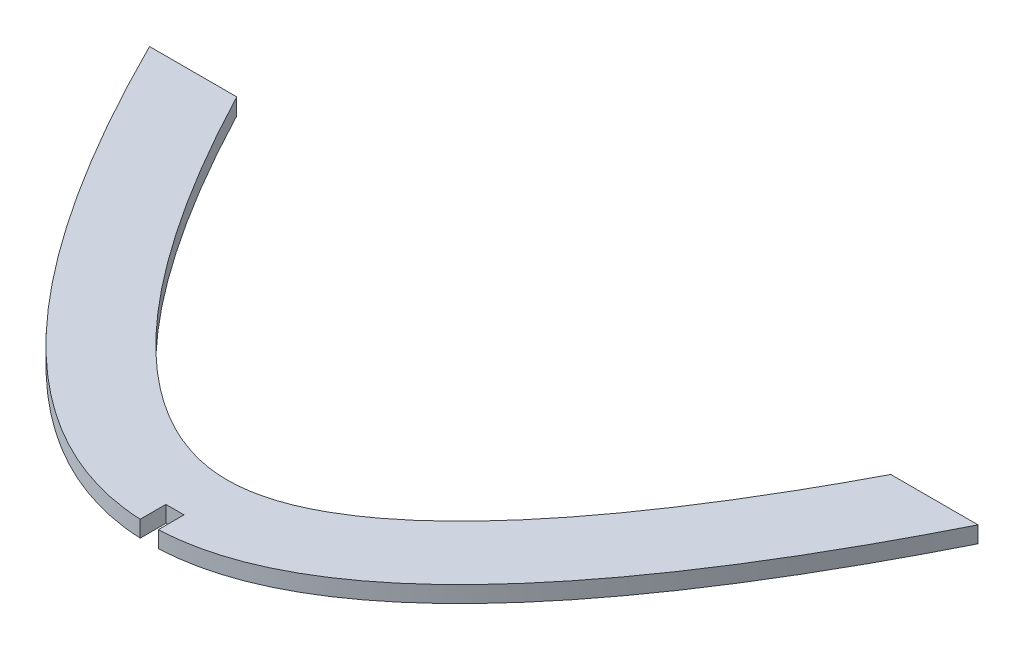
ISO-10303-21;
HEADER;
FILE_DESCRIPTION(('STEP AP214'),'2;1');
FILE_NAME('part.step','',(''),(''),'','','');
FILE_SCHEMA(('AUTOMOTIVE_DESIGN { 1 0 10303 214 1 1 1 1 }'));
ENDSEC;
DATA;
#1=APPLICATION_CONTEXT('core data for automotive mechanical design processes');
#2=APPLICATION_PROTOCOL_DEFINITION('international standard','automotive_design',2000,#1);
#3=PRODUCT_CONTEXT('',#1,'mechanical');
#4=PRODUCT('Part','Part','',(#3));
#5=PRODUCT_RELATED_PRODUCT_CATEGORY('part','',(#4));
#6=PRODUCT_DEFINITION_FORMATION('','',#4);
#7=PRODUCT_DEFINITION_CONTEXT('part definition',#1,'design');
#8=PRODUCT_DEFINITION('design','',#6,#7);
#9=PRODUCT_DEFINITION_SHAPE('','',#8);
#10=(LENGTH_UNIT() NAMED_UNIT(*) SI_UNIT(.MILLI.,.METRE.));
#11=(NAMED_UNIT(*) PLANE_ANGLE_UNIT() SI_UNIT($,.RADIAN.));
#12=(NAMED_UNIT(*) SI_UNIT($,.STERADIAN.) SOLID_ANGLE_UNIT());
#13=UNCERTAINTY_MEASURE_WITH_UNIT(LENGTH_MEASURE(1.E-05),#10,'distance_accuracy_value','');
#14=(GEOMETRIC_REPRESENTATION_CONTEXT(3) GLOBAL_UNCERTAINTY_ASSIGNED_CONTEXT((#13)) GLOBAL_UNIT_ASSIGNED_CONTEXT((#10,
#11,#12)) REPRESENTATION_CONTEXT('',''));
#15=CARTESIAN_POINT('',(0.,0.,0.));
#16=DIRECTION('',(0.,0.,1.));
#17=DIRECTION('',(1.,0.,0.));
#18=AXIS2_PLACEMENT_3D('',#15,#16,#17);
#19=CARTESIAN_POINT('',(-80.000000000081,3.175,-80.0000000001619));
#20=CARTESIAN_POINT('',(-1.22913831890337E-11,3.175,80.0000000001373));
#21=CARTESIAN_POINT('',(80.0000000000564,3.175,-80.0000000001128));
#22=B_SPLINE_CURVE_WITH_KNOTS('',2,(#19,#20,#21),.UNSPECIFIED.,.F.,.F.,(3,3),
(0.0560283962323778,0.943971603767486),.UNSPECIFIED.);
#23=DIRECTION('',(0.,-1.,0.));
#24=VECTOR('',#23,1.);
#25=SURFACE_OF_LINEAR_EXTRUSION('',#22,#24);
#26=CARTESIAN_POINT('',(-80.000000000081,0.,-80.0000000001619));
#27=CARTESIAN_POINT('',(-1.22913831890337E-11,0.,80.0000000001373));
#28=CARTESIAN_POINT('',(80.0000000000564,0.,-80.0000000001128));
#29=B_SPLINE_CURVE_WITH_KNOTS('',2,(#26,#27,#28),.UNSPECIFIED.,.F.,.F.,(3,3),
(0.0560283962323778,0.943971603767486),.UNSPECIFIED.);
#30=CARTESIAN_POINT('',(-80.000000000054,0.,-80.000000000108));
#31=VERTEX_POINT('',#30);
#32=CARTESIAN_POINT('',(-1.83811954016201,0.,-0.0422335430490694));
#33=VERTEX_POINT('',#32);
#34=EDGE_CURVE('E230',#31,#33,#29,.T.);
#35=ORIENTED_EDGE('',*,*,#34,.T.);
#36=DIRECTION('',(0.,-1.,0.));
#37=VECTOR('',#36,1.);
#38=CARTESIAN_POINT('',(-1.83811954016203,3.175,-0.0422335430490704));
#39=LINE('',#38,#37);
#40=CARTESIAN_POINT('',(-1.83811954016201,3.175,-0.0422335430490693));
#41=VERTEX_POINT('',#40);
#42=EDGE_CURVE('E134',#33,#41,#39,.F.);
#43=ORIENTED_EDGE('',*,*,#42,.T.);
#44=CARTESIAN_POINT('',(-80.000000000054,3.175,-80.000000000108));
#45=VERTEX_POINT('',#44);
#46=EDGE_CURVE('E154',#45,#41,#22,.T.);
#47=ORIENTED_EDGE('',*,*,#46,.F.);
#48=DIRECTION('',(0.,-1.,0.));
#49=VECTOR('',#48,1.);
#50=CARTESIAN_POINT('',(-80.000000000054,3.175,-80.000000000108));
#51=LINE('',#50,#49);
#52=EDGE_CURVE('E208',#45,#31,#51,.T.);
#53=ORIENTED_EDGE('',*,*,#52,.T.);
#54=EDGE_LOOP('',(#35,#43,#47,#53));
#55=FACE_BOUND('',#54,.T.);
#56=ADVANCED_FACE('F34',(#55),#25,.F.);
#57=CARTESIAN_POINT('',(-66.5835921350804,3.175,-86.7082039326576));
#58=CARTESIAN_POINT('',(-66.1836797041629,3.175,-85.9083790708301));
#59=CARTESIAN_POINT('',(-65.3747857282876,3.175,-84.3031754699301));
#60=CARTESIAN_POINT('',(-63.7692477796461,3.175,-81.1674693269786));
#61=CARTESIAN_POINT('',(-61.7631935051656,3.175,-77.3434306580432));
#62=CARTESIAN_POINT('',(-59.3650026390533,3.175,-72.9219414843398));
#63=CARTESIAN_POINT('',(-56.1780716219019,3.175,-67.2453718616962));
#64=CARTESIAN_POINT('',(-52.2176352291751,3.175,-60.5632069550038));
#65=CARTESIAN_POINT('',(-47.5100516789714,3.175,-53.2091356472839));
#66=CARTESIAN_POINT('',(-42.8576315637832,3.175,-46.5232681165522));
#67=CARTESIAN_POINT('',(-36.7450221155367,3.175,-38.5032368645703));
#68=CARTESIAN_POINT('',(-29.3111610134377,3.175,-30.1609133363356));
#69=CARTESIAN_POINT('',(-20.8839513018131,3.175,-22.8242553912202));
#70=CARTESIAN_POINT('',(-13.1530337772453,3.175,-18.0420650986008));
#71=CARTESIAN_POINT('',(-6.25468999183443,3.175,-15.5059314040553));
#72=CARTESIAN_POINT('',(4.56009795896106E-10,3.175,-14.7470342978714));
#73=CARTESIAN_POINT('',(6.25468999272267,3.175,-15.5059314040551));
#74=CARTESIAN_POINT('',(13.1530337780727,3.175,-18.0420650985882));
#75=CARTESIAN_POINT('',(20.8839513025574,3.175,-22.8242553911865));
#76=CARTESIAN_POINT('',(29.3111610140805,3.175,-30.1609133362797));
#77=CARTESIAN_POINT('',(36.7450221160781,3.175,-38.5032368644982));
#78=CARTESIAN_POINT('',(42.8576315642324,3.175,-46.5232681164691));
#79=CARTESIAN_POINT('',(47.5100516793455,3.175,-53.2091356471934));
#80=CARTESIAN_POINT('',(52.2176352294682,3.175,-60.5632069549067));
#81=CARTESIAN_POINT('',(56.1780716221222,3.175,-67.2453718615944));
#82=CARTESIAN_POINT('',(59.3650026392123,3.175,-72.9219414842344));
#83=CARTESIAN_POINT('',(61.763193505277,3.175,-77.3434306579353));
#84=CARTESIAN_POINT('',(63.7692477797165,3.175,-81.1674693268689));
#85=CARTESIAN_POINT('',(65.3747857283244,3.175,-84.3031754698188));
#86=CARTESIAN_POINT('',(66.1836797041826,3.175,-85.9083790707182));
#87=CARTESIAN_POINT('',(66.5835921350915,3.175,-86.7082039325453));
#88=B_SPLINE_CURVE_WITH_KNOTS('',3,(#57,#58,#59,#60,#61,#62,#63,#64,#65,#66,#67,#68,#69,#70,#71,
#72,#73,#74,#75,#76,#77,#78,#79,#80,#81,#82,#83,#84,#85,#86,#87),.UNSPECIFIED.,.F.,.F.,(4,1,1,1,
1,1,1,1,1,1,1,1,1,1,1,1,1,1,1,1,1,1,1,1,1,1,1,1,4),(0.0560283962311799,0.0629654525400496,
0.0699025088489193,0.0837766214666586,0.097650734084398,0.111524846702137,0.139273071937616,
0.167021297173095,0.194769522408573,0.222517747644052,0.278014198115009,0.333510648585967,
0.389007099056924,0.444503549527882,0.499999999998839,0.555496450469796,0.610992900940754,
0.666489351411711,0.721985801882669,0.777482252353626,0.805230477589105,0.832978702824583,
0.860726928060062,0.888475153295541,0.90234926591328,0.916223378531019,0.930097491148759,
0.937034547457628,0.943971603766498),.UNSPECIFIED.);
#89=DIRECTION('',(0.,-1.,0.));
#90=VECTOR('',#89,1.);
#91=SURFACE_OF_LINEAR_EXTRUSION('',#88,#90);
#92=CARTESIAN_POINT('',(-66.5835921350804,0.,-86.7082039326576));
#93=CARTESIAN_POINT('',(-66.1836797041629,0.,-85.9083790708301));
#94=CARTESIAN_POINT('',(-65.3747857282876,0.,-84.3031754699301));
#95=CARTESIAN_POINT('',(-63.7692477796461,0.,-81.1674693269786));
#96=CARTESIAN_POINT('',(-61.7631935051656,0.,-77.3434306580432));
#97=CARTESIAN_POINT('',(-59.3650026390533,0.,-72.9219414843398));
#98=CARTESIAN_POINT('',(-56.1780716219019,0.,-67.2453718616962));
#99=CARTESIAN_POINT('',(-52.2176352291751,0.,-60.5632069550038));
#100=CARTESIAN_POINT('',(-47.5100516789714,0.,-53.2091356472839));
#101=CARTESIAN_POINT('',(-42.8576315637832,0.,-46.5232681165522));
#102=CARTESIAN_POINT('',(-36.7450221155367,0.,-38.5032368645703));
#103=CARTESIAN_POINT('',(-29.3111610134377,0.,-30.1609133363356));
#104=CARTESIAN_POINT('',(-20.8839513018131,0.,-22.8242553912202));
#105=CARTESIAN_POINT('',(-13.1530337772453,0.,-18.0420650986008));
#106=CARTESIAN_POINT('',(-6.25468999183443,0.,-15.5059314040553));
#107=CARTESIAN_POINT('',(4.56009795896106E-10,0.,-14.7470342978714));
#108=CARTESIAN_POINT('',(6.25468999272267,0.,-15.5059314040551));
#109=CARTESIAN_POINT('',(13.1530337780727,0.,-18.0420650985882));
#110=CARTESIAN_POINT('',(20.8839513025574,0.,-22.8242553911865));
#111=CARTESIAN_POINT('',(29.3111610140805,0.,-30.1609133362797));
#112=CARTESIAN_POINT('',(36.7450221160781,0.,-38.5032368644982));
#113=CARTESIAN_POINT('',(42.8576315642324,0.,-46.5232681164691));
#114=CARTESIAN_POINT('',(47.5100516793455,0.,-53.2091356471934));
#115=CARTESIAN_POINT('',(52.2176352294682,0.,-60.5632069549067));
#116=CARTESIAN_POINT('',(56.1780716221222,0.,-67.2453718615944));
#117=CARTESIAN_POINT('',(59.3650026392123,0.,-72.9219414842344));
#118=CARTESIAN_POINT('',(61.763193505277,0.,-77.3434306579353));
#119=CARTESIAN_POINT('',(63.7692477797165,0.,-81.1674693268689));
#120=CARTESIAN_POINT('',(65.3747857283244,0.,-84.3031754698188));
#121=CARTESIAN_POINT('',(66.1836797041826,0.,-85.9083790707182));
#122=CARTESIAN_POINT('',(66.5835921350915,0.,-86.7082039325453));
#123=B_SPLINE_CURVE_WITH_KNOTS('',3,(#92,#93,#94,#95,#96,#97,#98,#99,#100,#101,#102,#103,#104,
#105,#106,#107,#108,#109,#110,#111,#112,#113,#114,#115,#116,#117,#118,#119,#120,#121,#122),
.UNSPECIFIED.,.F.,.F.,(4,1,1,1,1,1,1,1,1,1,1,1,1,1,1,1,1,1,1,1,1,1,1,1,1,1,1,1,4),
(0.0560283962311799,0.0629654525400496,0.0699025088489193,0.0837766214666586,0.097650734084398,
0.111524846702137,0.139273071937616,0.167021297173095,0.194769522408573,0.222517747644052,
0.278014198115009,0.333510648585967,0.389007099056924,0.444503549527882,0.499999999998839,
0.555496450469796,0.610992900940754,0.666489351411711,0.721985801882669,0.777482252353626,
0.805230477589105,0.832978702824583,0.860726928060062,0.888475153295541,0.90234926591328,
0.916223378531019,0.930097491148759,0.937034547457628,0.943971603766498),.UNSPECIFIED.);
#124=CARTESIAN_POINT('',(-63.1532923673527,0.,-80.0000026035873));
#125=VERTEX_POINT('',#124);
#126=CARTESIAN_POINT('',(63.153292367561,0.,-80.0000026037394));
#127=VERTEX_POINT('',#126);
#128=EDGE_CURVE('E137',#125,#127,#123,.T.);
#129=ORIENTED_EDGE('',*,*,#128,.F.);
#130=CARTESIAN_POINT('',(-63.1532874263877,0.,-80.0000052725084));
#131=DIRECTION('',(0.,1.,0.));
#132=VECTOR('',#131,1.);
#133=LINE('',#130,#132);
#134=CARTESIAN_POINT('',(-63.1532923673527,3.175,-80.0000026035873));
#135=VERTEX_POINT('',#134);
#136=EDGE_CURVE('E85',#135,#125,#133,.F.);
#137=ORIENTED_EDGE('',*,*,#136,.F.);
#138=CARTESIAN_POINT('',(63.153292367561,3.175,-80.0000026037394));
#139=VERTEX_POINT('',#138);
#140=EDGE_CURVE('E138',#135,#139,#88,.T.);
#141=ORIENTED_EDGE('',*,*,#140,.T.);
#142=CARTESIAN_POINT('',(63.1532873923015,3.175,-80.0000052070991));
#143=DIRECTION('',(0.,-1.,0.));
#144=VECTOR('',#143,1.);
#145=LINE('',#142,#144);
#146=EDGE_CURVE('E60',#139,#127,#145,.T.);
#147=ORIENTED_EDGE('',*,*,#146,.T.);
#148=EDGE_LOOP('',(#129,#137,#141,#147));
#149=FACE_BOUND('',#148,.T.);
#150=ADVANCED_FACE('F36',(#149),#91,.T.);
#151=CARTESIAN_POINT('',(-1.97704508804787E-13,3.175,-80.0000000001082));
#152=DIRECTION('',(0.,0.,-1.));
#153=DIRECTION('',(-1.,0.,0.));
#154=AXIS2_PLACEMENT_3D('',#151,#152,#153);
#155=PLANE('',#154);
#156=DIRECTION('',(1.,0.,0.));
#157=VECTOR('',#156,1.);
#158=CARTESIAN_POINT('',(-1.97704508804787E-13,0.,-80.0000000001082));
#159=LINE('',#158,#157);
#160=EDGE_CURVE('E239',#31,#125,#159,.T.);
#161=ORIENTED_EDGE('',*,*,#160,.F.);
#162=ORIENTED_EDGE('',*,*,#52,.F.);
#163=DIRECTION('',(1.,0.,0.));
#164=VECTOR('',#163,1.);
#165=CARTESIAN_POINT('',(-1.97704508804787E-13,3.175,-80.0000000001082));
#166=LINE('',#165,#164);
#167=EDGE_CURVE('E139',#45,#135,#166,.T.);
#168=ORIENTED_EDGE('',*,*,#167,.T.);
#169=ORIENTED_EDGE('',*,*,#136,.T.);
#170=EDGE_LOOP('',(#161,#162,#168,#169));
#171=FACE_BOUND('',#170,.T.);
#172=ADVANCED_FACE('F169',(#171),#155,.T.);
#173=CARTESIAN_POINT('',(1.66188045983799,3.175,-0.0345230832848971));
#174=VERTEX_POINT('',#173);
#175=CARTESIAN_POINT('',(80.0000000001213,3.175,-80.000000000108));
#176=VERTEX_POINT('',#175);
#177=EDGE_CURVE('E151',#174,#176,#22,.T.);
#178=ORIENTED_EDGE('',*,*,#177,.F.);
#179=DIRECTION('',(0.,-1.,0.));
#180=VECTOR('',#179,1.);
#181=CARTESIAN_POINT('',(1.66188045983801,3.175,-0.0345230832848979));
#182=LINE('',#181,#180);
#183=CARTESIAN_POINT('',(1.66188045983799,0.,-0.0345230832848969));
#184=VERTEX_POINT('',#183);
#185=EDGE_CURVE('E122',#174,#184,#182,.T.);
#186=ORIENTED_EDGE('',*,*,#185,.T.);
#187=CARTESIAN_POINT('',(80.0000000001213,0.,-80.000000000108));
#188=VERTEX_POINT('',#187);
#189=EDGE_CURVE('E202',#184,#188,#29,.T.);
#190=ORIENTED_EDGE('',*,*,#189,.T.);
#191=DIRECTION('',(0.,-1.,0.));
#192=VECTOR('',#191,1.);
#193=CARTESIAN_POINT('',(80.0000000001213,3.175,-80.000000000108));
#194=LINE('',#193,#192);
#195=EDGE_CURVE('E205',#176,#188,#194,.T.);
#196=ORIENTED_EDGE('',*,*,#195,.F.);
#197=EDGE_LOOP('',(#178,#186,#190,#196));
#198=FACE_BOUND('',#197,.T.);
#199=ADVANCED_FACE('F165',(#198),#25,.F.);
#200=CARTESIAN_POINT('',(0.,3.175,-80.000000000108));
#201=DIRECTION('',(0.,0.,-1.));
#202=DIRECTION('',(-1.,0.,0.));
#203=AXIS2_PLACEMENT_3D('',#200,#201,#202);
#204=PLANE('',#203);
#205=DIRECTION('',(1.,0.,0.));
#206=VECTOR('',#205,1.);
#207=CARTESIAN_POINT('',(0.,0.,-80.000000000108));
#208=LINE('',#207,#206);
#209=EDGE_CURVE('E140',#127,#188,#208,.T.);
#210=ORIENTED_EDGE('',*,*,#209,.F.);
#211=ORIENTED_EDGE('',*,*,#146,.F.);
#212=DIRECTION('',(1.,0.,0.));
#213=VECTOR('',#212,1.);
#214=CARTESIAN_POINT('',(0.,3.175,-80.000000000108));
#215=LINE('',#214,#213);
#216=EDGE_CURVE('E159',#139,#176,#215,.T.);
#217=ORIENTED_EDGE('',*,*,#216,.T.);
#218=ORIENTED_EDGE('',*,*,#195,.T.);
#219=EDGE_LOOP('',(#210,#211,#217,#218));
#220=FACE_BOUND('',#219,.T.);
#221=ADVANCED_FACE('F168',(#220),#204,.T.);
#222=CARTESIAN_POINT('',(0.,3.175,0.));
#223=DIRECTION('',(0.,1.,0.));
#224=DIRECTION('',(0.,0.,1.));
#225=AXIS2_PLACEMENT_3D('',#222,#223,#224);
#226=PLANE('',#225);
#227=DIRECTION('',(0.,0.,1.));
#228=VECTOR('',#227,1.);
#229=CARTESIAN_POINT('',(-1.83811954016201,3.175,-5.));
#230=LINE('',#229,#228);
#231=CARTESIAN_POINT('',(-1.83811954016201,3.175,-5.));
#232=VERTEX_POINT('',#231);
#233=EDGE_CURVE('E125',#232,#41,#230,.T.);
#234=ORIENTED_EDGE('',*,*,#233,.F.);
#235=DIRECTION('',(-1.,0.,0.));
#236=VECTOR('',#235,1.);
#237=CARTESIAN_POINT('',(-1.83811954016201,3.175,-5.));
#238=LINE('',#237,#236);
#239=CARTESIAN_POINT('',(1.66188045983799,3.175,-5.));
#240=VERTEX_POINT('',#239);
#241=EDGE_CURVE('E112',#240,#232,#238,.T.);
#242=ORIENTED_EDGE('',*,*,#241,.F.);
#243=DIRECTION('',(0.,0.,-1.));
#244=VECTOR('',#243,1.);
#245=CARTESIAN_POINT('',(1.66188045983799,3.175,-5.));
#246=LINE('',#245,#244);
#247=EDGE_CURVE('E119',#174,#240,#246,.T.);
#248=ORIENTED_EDGE('',*,*,#247,.F.);
#249=ORIENTED_EDGE('',*,*,#177,.T.);
#250=ORIENTED_EDGE('',*,*,#216,.F.);
#251=ORIENTED_EDGE('',*,*,#140,.F.);
#252=ORIENTED_EDGE('',*,*,#167,.F.);
#253=ORIENTED_EDGE('',*,*,#46,.T.);
#254=EDGE_LOOP('',(#234,#242,#248,#249,#250,#251,#252,#253));
#255=FACE_BOUND('',#254,.T.);
#256=ADVANCED_FACE('F127',(#255),#226,.T.);
#257=CARTESIAN_POINT('',(0.,0.,0.));
#258=DIRECTION('',(0.,1.,0.));
#259=DIRECTION('',(0.,0.,1.));
#260=AXIS2_PLACEMENT_3D('',#257,#258,#259);
#261=PLANE('',#260);
#262=DIRECTION('',(-1.,0.,0.));
#263=VECTOR('',#262,1.);
#264=CARTESIAN_POINT('',(0.,0.,-5.));
#265=LINE('',#264,#263);
#266=CARTESIAN_POINT('',(1.66188045983799,0.,-5.));
#267=VERTEX_POINT('',#266);
#268=CARTESIAN_POINT('',(-1.83811954016201,0.,-5.));
#269=VERTEX_POINT('',#268);
#270=EDGE_CURVE('E44',#267,#269,#265,.T.);
#271=ORIENTED_EDGE('',*,*,#270,.T.);
#272=DIRECTION('',(0.,0.,1.));
#273=VECTOR('',#272,1.);
#274=CARTESIAN_POINT('',(-1.83811954016201,0.,0.));
#275=LINE('',#274,#273);
#276=EDGE_CURVE('E11',#269,#33,#275,.T.);
#277=ORIENTED_EDGE('',*,*,#276,.T.);
#278=ORIENTED_EDGE('',*,*,#34,.F.);
#279=ORIENTED_EDGE('',*,*,#160,.T.);
#280=ORIENTED_EDGE('',*,*,#128,.T.);
#281=ORIENTED_EDGE('',*,*,#209,.T.);
#282=ORIENTED_EDGE('',*,*,#189,.F.);
#283=DIRECTION('',(0.,0.,-1.));
#284=VECTOR('',#283,1.);
#285=CARTESIAN_POINT('',(1.66188045983799,0.,0.));
#286=LINE('',#285,#284);
#287=EDGE_CURVE('E190',#184,#267,#286,.T.);
#288=ORIENTED_EDGE('',*,*,#287,.T.);
#289=EDGE_LOOP('',(#271,#277,#278,#279,#280,#281,#282,#288));
#290=FACE_BOUND('',#289,.T.);
#291=ADVANCED_FACE('F197',(#290),#261,.F.);
#292=CARTESIAN_POINT('',(-1.83811954016201,-5.30761470282116E-05,-5.));
#293=DIRECTION('',(-1.,0.,0.));
#294=DIRECTION('',(0.,0.,1.));
#295=AXIS2_PLACEMENT_3D('',#292,#293,#294);
#296=PLANE('',#295);
#297=ORIENTED_EDGE('',*,*,#276,.F.);
#298=DIRECTION('',(0.,1.,0.));
#299=VECTOR('',#298,1.);
#300=CARTESIAN_POINT('',(-1.83811954016201,-5.30761470282116E-05,-5.));
#301=LINE('',#300,#299);
#302=EDGE_CURVE('E116',#269,#232,#301,.T.);
#303=ORIENTED_EDGE('',*,*,#302,.T.);
#304=ORIENTED_EDGE('',*,*,#233,.T.);
#305=ORIENTED_EDGE('',*,*,#42,.F.);
#306=EDGE_LOOP('',(#297,#303,#304,#305));
#307=FACE_BOUND('',#306,.T.);
#308=ADVANCED_FACE('F263',(#307),#296,.F.);
#309=CARTESIAN_POINT('',(-1.83811954016201,-5.30761470282116E-05,-5.));
#310=DIRECTION('',(0.,0.,-1.));
#311=DIRECTION('',(-1.,0.,0.));
#312=AXIS2_PLACEMENT_3D('',#309,#310,#311);
#313=PLANE('',#312);
#314=DIRECTION('',(0.,1.,0.));
#315=VECTOR('',#314,1.);
#316=CARTESIAN_POINT('',(1.66188045983799,-5.30761470282116E-05,-5.));
#317=LINE('',#316,#315);
#318=EDGE_CURVE('E51',#267,#240,#317,.T.);
#319=ORIENTED_EDGE('',*,*,#318,.T.);
#320=ORIENTED_EDGE('',*,*,#241,.T.);
#321=ORIENTED_EDGE('',*,*,#302,.F.);
#322=ORIENTED_EDGE('',*,*,#270,.F.);
#323=EDGE_LOOP('',(#319,#320,#321,#322));
#324=FACE_BOUND('',#323,.T.);
#325=ADVANCED_FACE('F109',(#324),#313,.F.);
#326=CARTESIAN_POINT('',(1.66188045983799,-5.30761470282116E-05,-5.));
#327=DIRECTION('',(1.,0.,0.));
#328=DIRECTION('',(0.,0.,-1.));
#329=AXIS2_PLACEMENT_3D('',#326,#327,#328);
#330=PLANE('',#329);
#331=ORIENTED_EDGE('',*,*,#247,.T.);
#332=ORIENTED_EDGE('',*,*,#318,.F.);
#333=ORIENTED_EDGE('',*,*,#287,.F.);
#334=ORIENTED_EDGE('',*,*,#185,.F.);
#335=EDGE_LOOP('',(#331,#332,#333,#334));
#336=FACE_BOUND('',#335,.T.);
#337=ADVANCED_FACE('F120',(#336),#330,.F.);
#338=CLOSED_SHELL('',(#56,#150,#172,#199,#221,#256,#291,#308,#325,#337));
#339=MANIFOLD_SOLID_BREP('B2',#338);
#340=ADVANCED_BREP_SHAPE_REPRESENTATION('',(#18,#339),#14);
#341=SHAPE_DEFINITION_REPRESENTATION(#9,#340);
ENDSEC;
END-ISO-10303-21;
